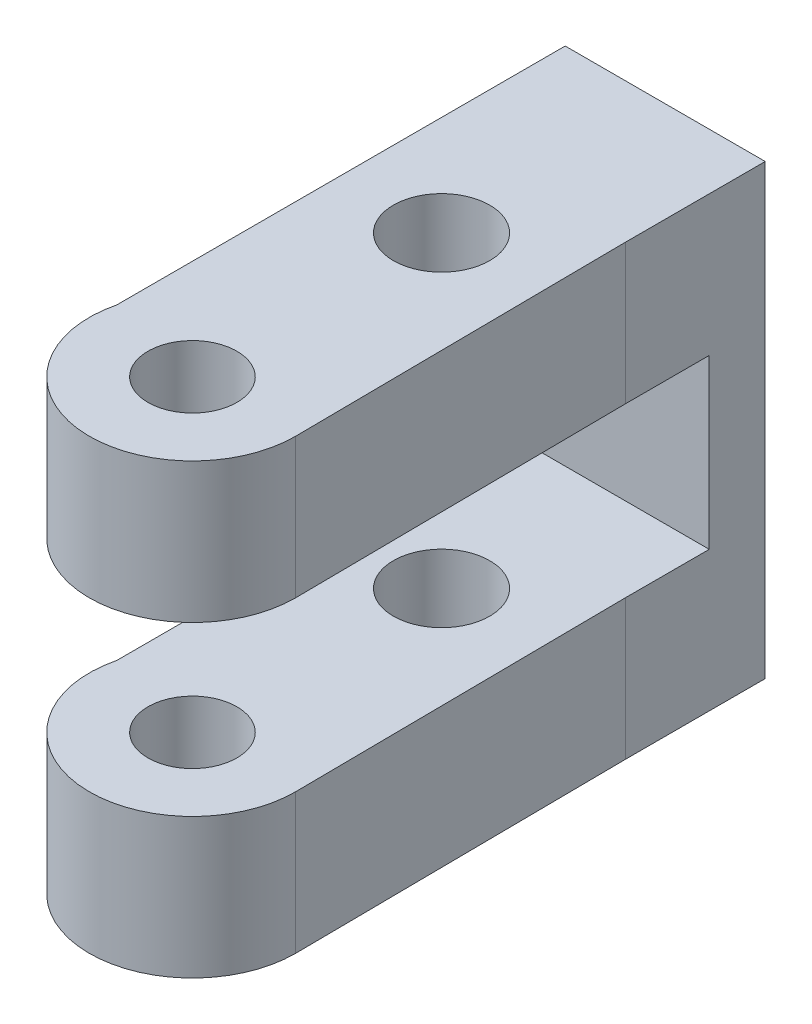
ISO-10303-21;
HEADER;
FILE_DESCRIPTION(('STEP AP214'),'2;1');
FILE_NAME('part.step','',(''),(''),'','','');
FILE_SCHEMA(('AUTOMOTIVE_DESIGN { 1 0 10303 214 1 1 1 1 }'));
ENDSEC;
DATA;
#1=APPLICATION_CONTEXT('core data for automotive mechanical design processes');
#2=APPLICATION_PROTOCOL_DEFINITION('international standard','automotive_design',2000,#1);
#3=PRODUCT_CONTEXT('',#1,'mechanical');
#4=PRODUCT('Part','Part','',(#3));
#5=PRODUCT_RELATED_PRODUCT_CATEGORY('part','',(#4));
#6=PRODUCT_DEFINITION_FORMATION('','',#4);
#7=PRODUCT_DEFINITION_CONTEXT('part definition',#1,'design');
#8=PRODUCT_DEFINITION('design','',#6,#7);
#9=PRODUCT_DEFINITION_SHAPE('','',#8);
#10=(LENGTH_UNIT() NAMED_UNIT(*) SI_UNIT(.MILLI.,.METRE.));
#11=(NAMED_UNIT(*) PLANE_ANGLE_UNIT() SI_UNIT($,.RADIAN.));
#12=(NAMED_UNIT(*) SI_UNIT($,.STERADIAN.) SOLID_ANGLE_UNIT());
#13=UNCERTAINTY_MEASURE_WITH_UNIT(LENGTH_MEASURE(1.E-05),#10,'distance_accuracy_value','');
#14=(GEOMETRIC_REPRESENTATION_CONTEXT(3) GLOBAL_UNCERTAINTY_ASSIGNED_CONTEXT((#13)) GLOBAL_UNIT_ASSIGNED_CONTEXT((#10,
#11,#12)) REPRESENTATION_CONTEXT('',''));
#15=CARTESIAN_POINT('',(0.,0.,0.));
#16=DIRECTION('',(0.,0.,1.));
#17=DIRECTION('',(1.,0.,0.));
#18=AXIS2_PLACEMENT_3D('',#15,#16,#17);
#19=CARTESIAN_POINT('',(50.0036407247273,-5.,-34.1274682353973));
#20=DIRECTION('',(0.,1.,0.));
#21=DIRECTION('',(0.,0.,1.));
#22=AXIS2_PLACEMENT_3D('',#19,#20,#21);
#23=CYLINDRICAL_SURFACE('',#22,3.6815824557957);
#24=CARTESIAN_POINT('',(50.0036407247273,0.,-34.1274682353973));
#25=DIRECTION('',(0.,1.,0.));
#26=DIRECTION('',(0.,0.,1.));
#27=AXIS2_PLACEMENT_3D('',#24,#25,#26);
#28=CIRCLE('',#27,3.6815824557957);
#29=CARTESIAN_POINT('',(53.685223180523,0.,-34.1274682353973));
#30=VERTEX_POINT('',#29);
#31=CARTESIAN_POINT('',(46.4269470422068,0.,-35.));
#32=VERTEX_POINT('',#31);
#33=EDGE_CURVE('E191',#30,#32,#28,.F.);
#34=ORIENTED_EDGE('',*,*,#33,.T.);
#35=DIRECTION('',(0.,1.,0.));
#36=VECTOR('',#35,1.);
#37=CARTESIAN_POINT('',(46.4269470422068,-5.,-35.));
#38=LINE('',#37,#36);
#39=CARTESIAN_POINT('',(46.4269470422068,-5.,-35.));
#40=VERTEX_POINT('',#39);
#41=EDGE_CURVE('E11',#40,#32,#38,.T.);
#42=ORIENTED_EDGE('',*,*,#41,.F.);
#43=CARTESIAN_POINT('',(50.0036407247273,-5.,-34.1274682353973));
#44=DIRECTION('',(0.,1.,0.));
#45=DIRECTION('',(0.,0.,1.));
#46=AXIS2_PLACEMENT_3D('',#43,#44,#45);
#47=CIRCLE('',#46,3.6815824557957);
#48=CARTESIAN_POINT('',(53.685223180523,-5.,-34.1274682353973));
#49=VERTEX_POINT('',#48);
#50=EDGE_CURVE('E198',#49,#40,#47,.F.);
#51=ORIENTED_EDGE('',*,*,#50,.F.);
#52=DIRECTION('',(0.,1.,0.));
#53=VECTOR('',#52,1.);
#54=CARTESIAN_POINT('',(53.685223180523,-5.,-34.1274682353973));
#55=LINE('',#54,#53);
#56=EDGE_CURVE('E44',#49,#30,#55,.T.);
#57=ORIENTED_EDGE('',*,*,#56,.T.);
#58=EDGE_LOOP('',(#34,#42,#51,#57));
#59=FACE_BOUND('',#58,.T.);
#60=ADVANCED_FACE('F41',(#59),#23,.T.);
#61=CARTESIAN_POINT('',(46.4269470422051,-5.,1.84700284956691E-12));
#62=DIRECTION('',(1.,0.,0.));
#63=DIRECTION('',(0.,0.,-1.));
#64=AXIS2_PLACEMENT_3D('',#61,#62,#63);
#65=PLANE('',#64);
#66=DIRECTION('',(0.,0.,-1.));
#67=VECTOR('',#66,1.);
#68=CARTESIAN_POINT('',(46.4269470422051,0.,1.84700284956691E-12));
#69=LINE('',#68,#67);
#70=CARTESIAN_POINT('',(46.4269470422071,0.,-51.0216303773125));
#71=VERTEX_POINT('',#70);
#72=EDGE_CURVE('E81',#32,#71,#69,.T.);
#73=ORIENTED_EDGE('',*,*,#72,.T.);
#74=DIRECTION('',(0.,1.,0.));
#75=VECTOR('',#74,1.);
#76=CARTESIAN_POINT('',(46.4269470422071,-11.,-51.0216303773125));
#77=LINE('',#76,#75);
#78=CARTESIAN_POINT('',(46.4269470422071,-16.,-51.0216303773125));
#79=VERTEX_POINT('',#78);
#80=EDGE_CURVE('E188',#79,#71,#77,.T.);
#81=ORIENTED_EDGE('',*,*,#80,.F.);
#82=DIRECTION('',(0.,0.,-1.));
#83=VECTOR('',#82,1.);
#84=CARTESIAN_POINT('',(46.4269470422051,-16.,1.84700284956691E-12));
#85=LINE('',#84,#83);
#86=CARTESIAN_POINT('',(46.4269470422068,-16.,-35.));
#87=VERTEX_POINT('',#86);
#88=EDGE_CURVE('E159',#87,#79,#85,.T.);
#89=ORIENTED_EDGE('',*,*,#88,.F.);
#90=DIRECTION('',(0.,1.,0.));
#91=VECTOR('',#90,1.);
#92=CARTESIAN_POINT('',(46.4269470422068,-16.,-35.));
#93=LINE('',#92,#91);
#94=CARTESIAN_POINT('',(46.4269470422068,-11.,-35.));
#95=VERTEX_POINT('',#94);
#96=EDGE_CURVE('E143',#87,#95,#93,.T.);
#97=ORIENTED_EDGE('',*,*,#96,.T.);
#98=DIRECTION('',(0.,0.,-1.));
#99=VECTOR('',#98,1.);
#100=CARTESIAN_POINT('',(46.4269470422051,-11.,1.84700284956691E-12));
#101=LINE('',#100,#99);
#102=CARTESIAN_POINT('',(46.426947042207,-11.,-49.0216303773125));
#103=VERTEX_POINT('',#102);
#104=EDGE_CURVE('E171',#95,#103,#101,.T.);
#105=ORIENTED_EDGE('',*,*,#104,.T.);
#106=DIRECTION('',(0.,1.,0.));
#107=VECTOR('',#106,1.);
#108=CARTESIAN_POINT('',(46.426947042207,-11.,-49.0216303773125));
#109=LINE('',#108,#107);
#110=CARTESIAN_POINT('',(46.426947042207,-5.,-49.0216303773125));
#111=VERTEX_POINT('',#110);
#112=EDGE_CURVE('E185',#103,#111,#109,.T.);
#113=ORIENTED_EDGE('',*,*,#112,.T.);
#114=DIRECTION('',(0.,0.,-1.));
#115=VECTOR('',#114,1.);
#116=CARTESIAN_POINT('',(46.4269470422051,-5.,1.84700284956691E-12));
#117=LINE('',#116,#115);
#118=EDGE_CURVE('E58',#40,#111,#117,.T.);
#119=ORIENTED_EDGE('',*,*,#118,.F.);
#120=ORIENTED_EDGE('',*,*,#41,.T.);
#121=EDGE_LOOP('',(#73,#81,#89,#97,#105,#113,#119,#120));
#122=FACE_BOUND('',#121,.T.);
#123=ADVANCED_FACE('F249',(#122),#65,.F.);
#124=CARTESIAN_POINT('',(53.5730529577904,-5.,2.89955429854359E-12));
#125=DIRECTION('',(1.,0.,0.));
#126=DIRECTION('',(0.,0.,-1.));
#127=AXIS2_PLACEMENT_3D('',#124,#125,#126);
#128=PLANE('',#127);
#129=DIRECTION('',(0.,0.,-1.));
#130=VECTOR('',#129,1.);
#131=CARTESIAN_POINT('',(53.5730529577904,0.,2.89955429854359E-12));
#132=LINE('',#131,#130);
#133=CARTESIAN_POINT('',(53.5730529577929,0.,-46.0216303773125));
#134=VERTEX_POINT('',#133);
#135=CARTESIAN_POINT('',(53.5730529577932,0.,-51.0216303773125));
#136=VERTEX_POINT('',#135);
#137=EDGE_CURVE('E221',#134,#136,#132,.T.);
#138=ORIENTED_EDGE('',*,*,#137,.F.);
#139=DIRECTION('',(0.,1.,0.));
#140=VECTOR('',#139,1.);
#141=CARTESIAN_POINT('',(53.5730529577929,-5.,-46.0216303773125));
#142=LINE('',#141,#140);
#143=CARTESIAN_POINT('',(53.5730529577929,-5.,-46.0216303773125));
#144=VERTEX_POINT('',#143);
#145=EDGE_CURVE('E50',#144,#134,#142,.T.);
#146=ORIENTED_EDGE('',*,*,#145,.F.);
#147=DIRECTION('',(0.,0.,-1.));
#148=VECTOR('',#147,1.);
#149=CARTESIAN_POINT('',(53.5730529577904,-5.,2.89955429854359E-12));
#150=LINE('',#149,#148);
#151=CARTESIAN_POINT('',(53.5730529577931,-5.,-49.0216303773125));
#152=VERTEX_POINT('',#151);
#153=EDGE_CURVE('E203',#144,#152,#150,.T.);
#154=ORIENTED_EDGE('',*,*,#153,.T.);
#155=DIRECTION('',(0.,1.,0.));
#156=VECTOR('',#155,1.);
#157=CARTESIAN_POINT('',(53.5730529577931,-11.,-49.0216303773125));
#158=LINE('',#157,#156);
#159=CARTESIAN_POINT('',(53.5730529577931,-11.,-49.0216303773125));
#160=VERTEX_POINT('',#159);
#161=EDGE_CURVE('E195',#160,#152,#158,.T.);
#162=ORIENTED_EDGE('',*,*,#161,.F.);
#163=DIRECTION('',(0.,0.,-1.));
#164=VECTOR('',#163,1.);
#165=CARTESIAN_POINT('',(53.5730529577904,-11.,2.89955429854359E-12));
#166=LINE('',#165,#164);
#167=CARTESIAN_POINT('',(53.5730529577929,-11.,-46.0216303773125));
#168=VERTEX_POINT('',#167);
#169=EDGE_CURVE('E169',#168,#160,#166,.T.);
#170=ORIENTED_EDGE('',*,*,#169,.F.);
#171=DIRECTION('',(0.,1.,0.));
#172=VECTOR('',#171,1.);
#173=CARTESIAN_POINT('',(53.5730529577929,-16.,-46.0216303773125));
#174=LINE('',#173,#172);
#175=CARTESIAN_POINT('',(53.5730529577929,-16.,-46.0216303773125));
#176=VERTEX_POINT('',#175);
#177=EDGE_CURVE('E135',#176,#168,#174,.T.);
#178=ORIENTED_EDGE('',*,*,#177,.F.);
#179=DIRECTION('',(0.,0.,-1.));
#180=VECTOR('',#179,1.);
#181=CARTESIAN_POINT('',(53.5730529577904,-16.,2.89955429854359E-12));
#182=LINE('',#181,#180);
#183=CARTESIAN_POINT('',(53.5730529577932,-16.,-51.0216303773125));
#184=VERTEX_POINT('',#183);
#185=EDGE_CURVE('E153',#176,#184,#182,.T.);
#186=ORIENTED_EDGE('',*,*,#185,.T.);
#187=DIRECTION('',(0.,1.,0.));
#188=VECTOR('',#187,1.);
#189=CARTESIAN_POINT('',(53.5730529577932,-11.,-51.0216303773125));
#190=LINE('',#189,#188);
#191=EDGE_CURVE('E192',#184,#136,#190,.T.);
#192=ORIENTED_EDGE('',*,*,#191,.T.);
#193=EDGE_LOOP('',(#138,#146,#154,#162,#170,#178,#186,#192));
#194=FACE_BOUND('',#193,.T.);
#195=ADVANCED_FACE('F244',(#194),#128,.T.);
#196=CARTESIAN_POINT('',(49.9999999999999,-5.,-43.0303520878043));
#197=DIRECTION('',(0.,1.,0.));
#198=DIRECTION('',(0.,0.,1.));
#199=AXIS2_PLACEMENT_3D('',#196,#197,#198);
#200=CYLINDRICAL_SURFACE('',#199,1.72030782694109);
#201=CARTESIAN_POINT('',(49.9999999999999,-5.,-43.0303520878043));
#202=DIRECTION('',(0.,1.,0.));
#203=DIRECTION('',(0.,0.,1.));
#204=AXIS2_PLACEMENT_3D('',#201,#202,#203);
#205=CIRCLE('',#204,1.72030782694109);
#206=CARTESIAN_POINT('',(49.9999999999999,-5.,-41.3100442608632));
#207=VERTEX_POINT('',#206);
#208=EDGE_CURVE('E210',#207,#207,#205,.T.);
#209=ORIENTED_EDGE('',*,*,#208,.F.);
#210=EDGE_LOOP('',(#209));
#211=FACE_BOUND('',#210,.T.);
#212=CARTESIAN_POINT('',(49.9999999999999,0.,-43.0303520878043));
#213=DIRECTION('',(0.,1.,0.));
#214=DIRECTION('',(0.,0.,1.));
#215=AXIS2_PLACEMENT_3D('',#212,#213,#214);
#216=CIRCLE('',#215,1.72030782694109);
#217=CARTESIAN_POINT('',(49.9999999999999,0.,-41.3100442608632));
#218=VERTEX_POINT('',#217);
#219=EDGE_CURVE('E224',#218,#218,#216,.T.);
#220=ORIENTED_EDGE('',*,*,#219,.T.);
#221=EDGE_LOOP('',(#220));
#222=FACE_BOUND('',#221,.T.);
#223=ADVANCED_FACE('F236',(#211,#222),#200,.F.);
#224=CARTESIAN_POINT('',(54.0022660908799,-5.,-0.509278933906215));
#225=DIRECTION('',(0.999955533956149,0.,-0.00943027626710674));
#226=DIRECTION('',(-0.00943027626710674,0.,-0.999955533956149));
#227=AXIS2_PLACEMENT_3D('',#224,#225,#226);
#228=PLANE('',#227);
#229=DIRECTION('',(-0.00943027626710674,0.,-0.999955533956149));
#230=VECTOR('',#229,1.);
#231=CARTESIAN_POINT('',(54.0022660908799,0.,-0.509278933906215));
#232=LINE('',#231,#230);
#233=EDGE_CURVE('E218',#30,#134,#232,.T.);
#234=ORIENTED_EDGE('',*,*,#233,.F.);
#235=ORIENTED_EDGE('',*,*,#56,.F.);
#236=DIRECTION('',(-0.00943027626710674,0.,-0.999955533956149));
#237=VECTOR('',#236,1.);
#238=CARTESIAN_POINT('',(54.0022660908799,-5.,-0.509278933906215));
#239=LINE('',#238,#237);
#240=EDGE_CURVE('E200',#49,#144,#239,.T.);
#241=ORIENTED_EDGE('',*,*,#240,.T.);
#242=ORIENTED_EDGE('',*,*,#145,.T.);
#243=EDGE_LOOP('',(#234,#235,#241,#242));
#244=FACE_BOUND('',#243,.T.);
#245=ADVANCED_FACE('F233',(#244),#228,.T.);
#246=CARTESIAN_POINT('',(50.0036407247273,-5.,-34.1274682353973));
#247=DIRECTION('',(0.,1.,0.));
#248=DIRECTION('',(0.,0.,1.));
#249=AXIS2_PLACEMENT_3D('',#246,#247,#248);
#250=CYLINDRICAL_SURFACE('',#249,1.5875);
#251=CARTESIAN_POINT('',(50.0036407247273,-5.,-34.1274682353973));
#252=DIRECTION('',(0.,1.,0.));
#253=DIRECTION('',(0.,0.,1.));
#254=AXIS2_PLACEMENT_3D('',#251,#252,#253);
#255=CIRCLE('',#254,1.5875);
#256=CARTESIAN_POINT('',(50.0036407247273,-5.,-32.5399682353973));
#257=VERTEX_POINT('',#256);
#258=EDGE_CURVE('E213',#257,#257,#255,.F.);
#259=ORIENTED_EDGE('',*,*,#258,.T.);
#260=EDGE_LOOP('',(#259));
#261=FACE_BOUND('',#260,.T.);
#262=CARTESIAN_POINT('',(50.0036407247273,0.,-34.1274682353973));
#263=DIRECTION('',(0.,1.,0.));
#264=DIRECTION('',(0.,0.,1.));
#265=AXIS2_PLACEMENT_3D('',#262,#263,#264);
#266=CIRCLE('',#265,1.5875);
#267=CARTESIAN_POINT('',(50.0036407247273,0.,-32.5399682353973));
#268=VERTEX_POINT('',#267);
#269=EDGE_CURVE('E201',#268,#268,#266,.F.);
#270=ORIENTED_EDGE('',*,*,#269,.F.);
#271=EDGE_LOOP('',(#270));
#272=FACE_BOUND('',#271,.T.);
#273=ADVANCED_FACE('F235',(#261,#272),#250,.F.);
#274=CARTESIAN_POINT('',(0.,-5.,0.));
#275=DIRECTION('',(0.,1.,0.));
#276=DIRECTION('',(0.,0.,1.));
#277=AXIS2_PLACEMENT_3D('',#274,#275,#276);
#278=PLANE('',#277);
#279=ORIENTED_EDGE('',*,*,#50,.T.);
#280=ORIENTED_EDGE('',*,*,#118,.T.);
#281=DIRECTION('',(1.,0.,0.));
#282=VECTOR('',#281,1.);
#283=CARTESIAN_POINT('',(0.,-5.,-49.0216303773125));
#284=LINE('',#283,#282);
#285=EDGE_CURVE('E206',#111,#152,#284,.T.);
#286=ORIENTED_EDGE('',*,*,#285,.T.);
#287=ORIENTED_EDGE('',*,*,#153,.F.);
#288=ORIENTED_EDGE('',*,*,#240,.F.);
#289=EDGE_LOOP('',(#279,#280,#286,#287,#288));
#290=FACE_BOUND('',#289,.T.);
#291=ORIENTED_EDGE('',*,*,#208,.T.);
#292=EDGE_LOOP('',(#291));
#293=FACE_BOUND('',#292,.T.);
#294=ORIENTED_EDGE('',*,*,#258,.F.);
#295=EDGE_LOOP('',(#294));
#296=FACE_BOUND('',#295,.T.);
#297=ADVANCED_FACE('F241',(#290,#293,#296),#278,.F.);
#298=CARTESIAN_POINT('',(0.,0.,0.));
#299=DIRECTION('',(0.,1.,0.));
#300=DIRECTION('',(0.,0.,1.));
#301=AXIS2_PLACEMENT_3D('',#298,#299,#300);
#302=PLANE('',#301);
#303=ORIENTED_EDGE('',*,*,#33,.F.);
#304=ORIENTED_EDGE('',*,*,#233,.T.);
#305=ORIENTED_EDGE('',*,*,#137,.T.);
#306=DIRECTION('',(1.,0.,0.));
#307=VECTOR('',#306,1.);
#308=CARTESIAN_POINT('',(0.,0.,-51.0216303773125));
#309=LINE('',#308,#307);
#310=EDGE_CURVE('E180',#71,#136,#309,.T.);
#311=ORIENTED_EDGE('',*,*,#310,.F.);
#312=ORIENTED_EDGE('',*,*,#72,.F.);
#313=EDGE_LOOP('',(#303,#304,#305,#311,#312));
#314=FACE_BOUND('',#313,.T.);
#315=ORIENTED_EDGE('',*,*,#219,.F.);
#316=EDGE_LOOP('',(#315));
#317=FACE_BOUND('',#316,.T.);
#318=ORIENTED_EDGE('',*,*,#269,.T.);
#319=EDGE_LOOP('',(#318));
#320=FACE_BOUND('',#319,.T.);
#321=ADVANCED_FACE('F231',(#314,#317,#320),#302,.T.);
#322=CARTESIAN_POINT('',(0.,-11.,-49.0216303773125));
#323=DIRECTION('',(0.,0.,1.));
#324=DIRECTION('',(1.,0.,0.));
#325=AXIS2_PLACEMENT_3D('',#322,#323,#324);
#326=PLANE('',#325);
#327=ORIENTED_EDGE('',*,*,#285,.F.);
#328=ORIENTED_EDGE('',*,*,#112,.F.);
#329=DIRECTION('',(1.,0.,0.));
#330=VECTOR('',#329,1.);
#331=CARTESIAN_POINT('',(0.,-11.,-49.0216303773125));
#332=LINE('',#331,#330);
#333=EDGE_CURVE('E182',#103,#160,#332,.T.);
#334=ORIENTED_EDGE('',*,*,#333,.T.);
#335=ORIENTED_EDGE('',*,*,#161,.T.);
#336=EDGE_LOOP('',(#327,#328,#334,#335));
#337=FACE_BOUND('',#336,.T.);
#338=ADVANCED_FACE('F261',(#337),#326,.T.);
#339=CARTESIAN_POINT('',(0.,-11.,-51.0216303773125));
#340=DIRECTION('',(0.,0.,1.));
#341=DIRECTION('',(1.,0.,0.));
#342=AXIS2_PLACEMENT_3D('',#339,#340,#341);
#343=PLANE('',#342);
#344=ORIENTED_EDGE('',*,*,#310,.T.);
#345=ORIENTED_EDGE('',*,*,#191,.F.);
#346=DIRECTION('',(1.,0.,0.));
#347=VECTOR('',#346,1.);
#348=CARTESIAN_POINT('',(0.,-16.,-51.0216303773125));
#349=LINE('',#348,#347);
#350=EDGE_CURVE('E155',#79,#184,#349,.T.);
#351=ORIENTED_EDGE('',*,*,#350,.F.);
#352=ORIENTED_EDGE('',*,*,#80,.T.);
#353=EDGE_LOOP('',(#344,#345,#351,#352));
#354=FACE_BOUND('',#353,.T.);
#355=ADVANCED_FACE('F267',(#354),#343,.F.);
#356=CARTESIAN_POINT('',(0.,-11.,0.));
#357=DIRECTION('',(0.,1.,0.));
#358=DIRECTION('',(0.,0.,1.));
#359=AXIS2_PLACEMENT_3D('',#356,#357,#358);
#360=PLANE('',#359);
#361=CARTESIAN_POINT('',(50.0036407247273,-11.,-34.1274682353973));
#362=DIRECTION('',(0.,1.,0.));
#363=DIRECTION('',(0.,0.,1.));
#364=AXIS2_PLACEMENT_3D('',#361,#362,#363);
#365=CIRCLE('',#364,1.5875);
#366=CARTESIAN_POINT('',(50.0036407247273,-11.,-32.5399682353973));
#367=VERTEX_POINT('',#366);
#368=EDGE_CURVE('E146',#367,#367,#365,.F.);
#369=ORIENTED_EDGE('',*,*,#368,.T.);
#370=EDGE_LOOP('',(#369));
#371=FACE_BOUND('',#370,.T.);
#372=CARTESIAN_POINT('',(49.9999999999999,-11.,-43.0303520878043));
#373=DIRECTION('',(0.,1.,0.));
#374=DIRECTION('',(0.,0.,1.));
#375=AXIS2_PLACEMENT_3D('',#372,#373,#374);
#376=CIRCLE('',#375,1.72030782694109);
#377=CARTESIAN_POINT('',(49.9999999999999,-11.,-41.3100442608632));
#378=VERTEX_POINT('',#377);
#379=EDGE_CURVE('E174',#378,#378,#376,.T.);
#380=ORIENTED_EDGE('',*,*,#379,.F.);
#381=EDGE_LOOP('',(#380));
#382=FACE_BOUND('',#381,.T.);
#383=ORIENTED_EDGE('',*,*,#333,.F.);
#384=ORIENTED_EDGE('',*,*,#104,.F.);
#385=CARTESIAN_POINT('',(50.0036407247273,-11.,-34.1274682353973));
#386=DIRECTION('',(0.,1.,0.));
#387=DIRECTION('',(0.,0.,1.));
#388=AXIS2_PLACEMENT_3D('',#385,#386,#387);
#389=CIRCLE('',#388,3.6815824557957);
#390=CARTESIAN_POINT('',(53.685223180523,-11.,-34.1274682353973));
#391=VERTEX_POINT('',#390);
#392=EDGE_CURVE('E166',#391,#95,#389,.F.);
#393=ORIENTED_EDGE('',*,*,#392,.F.);
#394=DIRECTION('',(-0.00943027626710674,0.,-0.999955533956149));
#395=VECTOR('',#394,1.);
#396=CARTESIAN_POINT('',(54.0022660908799,-11.,-0.509278933906215));
#397=LINE('',#396,#395);
#398=EDGE_CURVE('E131',#391,#168,#397,.T.);
#399=ORIENTED_EDGE('',*,*,#398,.T.);
#400=ORIENTED_EDGE('',*,*,#169,.T.);
#401=EDGE_LOOP('',(#383,#384,#393,#399,#400));
#402=FACE_BOUND('',#401,.T.);
#403=ADVANCED_FACE('F271',(#371,#382,#402),#360,.T.);
#404=CARTESIAN_POINT('',(50.0036407247273,-16.,-34.1274682353973));
#405=DIRECTION('',(0.,1.,0.));
#406=DIRECTION('',(0.,0.,1.));
#407=AXIS2_PLACEMENT_3D('',#404,#405,#406);
#408=CYLINDRICAL_SURFACE('',#407,3.6815824557957);
#409=ORIENTED_EDGE('',*,*,#392,.T.);
#410=ORIENTED_EDGE('',*,*,#96,.F.);
#411=CARTESIAN_POINT('',(50.0036407247273,-16.,-34.1274682353973));
#412=DIRECTION('',(0.,1.,0.));
#413=DIRECTION('',(0.,0.,1.));
#414=AXIS2_PLACEMENT_3D('',#411,#412,#413);
#415=CIRCLE('',#414,3.6815824557957);
#416=CARTESIAN_POINT('',(53.685223180523,-16.,-34.1274682353973));
#417=VERTEX_POINT('',#416);
#418=EDGE_CURVE('E140',#417,#87,#415,.F.);
#419=ORIENTED_EDGE('',*,*,#418,.F.);
#420=DIRECTION('',(0.,1.,0.));
#421=VECTOR('',#420,1.);
#422=CARTESIAN_POINT('',(53.685223180523,-16.,-34.1274682353973));
#423=LINE('',#422,#421);
#424=EDGE_CURVE('E125',#417,#391,#423,.T.);
#425=ORIENTED_EDGE('',*,*,#424,.T.);
#426=EDGE_LOOP('',(#409,#410,#419,#425));
#427=FACE_BOUND('',#426,.T.);
#428=ADVANCED_FACE('F141',(#427),#408,.T.);
#429=CARTESIAN_POINT('',(49.9999999999999,-16.,-43.0303520878043));
#430=DIRECTION('',(0.,1.,0.));
#431=DIRECTION('',(0.,0.,1.));
#432=AXIS2_PLACEMENT_3D('',#429,#430,#431);
#433=CYLINDRICAL_SURFACE('',#432,1.72030782694109);
#434=CARTESIAN_POINT('',(49.9999999999999,-16.,-43.0303520878043));
#435=DIRECTION('',(0.,1.,0.));
#436=DIRECTION('',(0.,0.,1.));
#437=AXIS2_PLACEMENT_3D('',#434,#435,#436);
#438=CIRCLE('',#437,1.72030782694109);
#439=CARTESIAN_POINT('',(49.9999999999999,-16.,-41.3100442608632));
#440=VERTEX_POINT('',#439);
#441=EDGE_CURVE('E161',#440,#440,#438,.T.);
#442=ORIENTED_EDGE('',*,*,#441,.F.);
#443=EDGE_LOOP('',(#442));
#444=FACE_BOUND('',#443,.T.);
#445=ORIENTED_EDGE('',*,*,#379,.T.);
#446=EDGE_LOOP('',(#445));
#447=FACE_BOUND('',#446,.T.);
#448=ADVANCED_FACE('F275',(#444,#447),#433,.F.);
#449=CARTESIAN_POINT('',(54.0022660908799,-16.,-0.509278933906215));
#450=DIRECTION('',(0.999955533956149,0.,-0.00943027626710674));
#451=DIRECTION('',(-0.00943027626710674,0.,-0.999955533956149));
#452=AXIS2_PLACEMENT_3D('',#449,#450,#451);
#453=PLANE('',#452);
#454=ORIENTED_EDGE('',*,*,#398,.F.);
#455=ORIENTED_EDGE('',*,*,#424,.F.);
#456=DIRECTION('',(-0.00943027626710674,0.,-0.999955533956149));
#457=VECTOR('',#456,1.);
#458=CARTESIAN_POINT('',(54.0022660908799,-16.,-0.509278933906215));
#459=LINE('',#458,#457);
#460=EDGE_CURVE('E129',#417,#176,#459,.T.);
#461=ORIENTED_EDGE('',*,*,#460,.T.);
#462=ORIENTED_EDGE('',*,*,#177,.T.);
#463=EDGE_LOOP('',(#454,#455,#461,#462));
#464=FACE_BOUND('',#463,.T.);
#465=ADVANCED_FACE('F127',(#464),#453,.T.);
#466=CARTESIAN_POINT('',(50.0036407247273,-16.,-34.1274682353973));
#467=DIRECTION('',(0.,1.,0.));
#468=DIRECTION('',(0.,0.,1.));
#469=AXIS2_PLACEMENT_3D('',#466,#467,#468);
#470=CYLINDRICAL_SURFACE('',#469,1.5875);
#471=CARTESIAN_POINT('',(50.0036407247273,-16.,-34.1274682353973));
#472=DIRECTION('',(0.,1.,0.));
#473=DIRECTION('',(0.,0.,1.));
#474=AXIS2_PLACEMENT_3D('',#471,#472,#473);
#475=CIRCLE('',#474,1.5875);
#476=CARTESIAN_POINT('',(50.0036407247273,-16.,-32.5399682353973));
#477=VERTEX_POINT('',#476);
#478=EDGE_CURVE('E136',#477,#477,#475,.F.);
#479=ORIENTED_EDGE('',*,*,#478,.T.);
#480=EDGE_LOOP('',(#479));
#481=FACE_BOUND('',#480,.T.);
#482=ORIENTED_EDGE('',*,*,#368,.F.);
#483=EDGE_LOOP('',(#482));
#484=FACE_BOUND('',#483,.T.);
#485=ADVANCED_FACE('F278',(#481,#484),#470,.F.);
#486=CARTESIAN_POINT('',(0.,-16.,0.));
#487=DIRECTION('',(0.,1.,0.));
#488=DIRECTION('',(0.,0.,1.));
#489=AXIS2_PLACEMENT_3D('',#486,#487,#488);
#490=PLANE('',#489);
#491=ORIENTED_EDGE('',*,*,#418,.T.);
#492=ORIENTED_EDGE('',*,*,#88,.T.);
#493=ORIENTED_EDGE('',*,*,#350,.T.);
#494=ORIENTED_EDGE('',*,*,#185,.F.);
#495=ORIENTED_EDGE('',*,*,#460,.F.);
#496=EDGE_LOOP('',(#491,#492,#493,#494,#495));
#497=FACE_BOUND('',#496,.T.);
#498=ORIENTED_EDGE('',*,*,#441,.T.);
#499=EDGE_LOOP('',(#498));
#500=FACE_BOUND('',#499,.T.);
#501=ORIENTED_EDGE('',*,*,#478,.F.);
#502=EDGE_LOOP('',(#501));
#503=FACE_BOUND('',#502,.T.);
#504=ADVANCED_FACE('F149',(#497,#500,#503),#490,.F.);
#505=CLOSED_SHELL('',(#60,#123,#195,#223,#245,#273,#297,#321,#338,#355,#403,#428,#448,#465,#485,#504));
#506=MANIFOLD_SOLID_BREP('B2',#505);
#507=ADVANCED_BREP_SHAPE_REPRESENTATION('',(#18,#506),#14);
#508=SHAPE_DEFINITION_REPRESENTATION(#9,#507);
ENDSEC;
END-ISO-10303-21;
